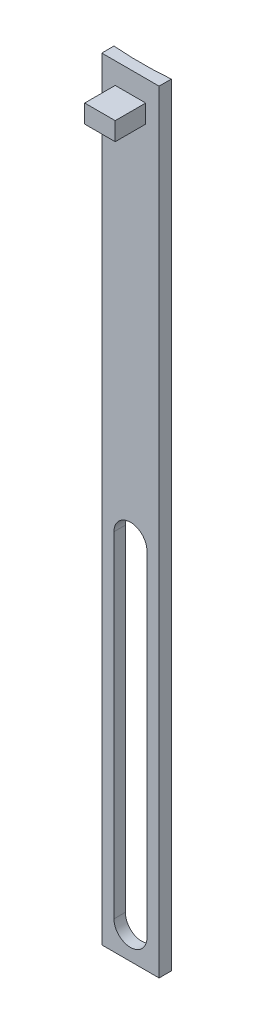
ISO-10303-21;
HEADER;
FILE_DESCRIPTION(('STEP AP214'),'2;1');
FILE_NAME('part.step','',(''),(''),'','','');
FILE_SCHEMA(('AUTOMOTIVE_DESIGN { 1 0 10303 214 1 1 1 1 }'));
ENDSEC;
DATA;
#1=APPLICATION_CONTEXT('core data for automotive mechanical design processes');
#2=APPLICATION_PROTOCOL_DEFINITION('international standard','automotive_design',2000,#1);
#3=PRODUCT_CONTEXT('',#1,'mechanical');
#4=PRODUCT('Part','Part','',(#3));
#5=PRODUCT_RELATED_PRODUCT_CATEGORY('part','',(#4));
#6=PRODUCT_DEFINITION_FORMATION('','',#4);
#7=PRODUCT_DEFINITION_CONTEXT('part definition',#1,'design');
#8=PRODUCT_DEFINITION('design','',#6,#7);
#9=PRODUCT_DEFINITION_SHAPE('','',#8);
#10=(LENGTH_UNIT() NAMED_UNIT(*) SI_UNIT(.MILLI.,.METRE.));
#11=(NAMED_UNIT(*) PLANE_ANGLE_UNIT() SI_UNIT($,.RADIAN.));
#12=(NAMED_UNIT(*) SI_UNIT($,.STERADIAN.) SOLID_ANGLE_UNIT());
#13=UNCERTAINTY_MEASURE_WITH_UNIT(LENGTH_MEASURE(1.E-05),#10,'distance_accuracy_value','');
#14=(GEOMETRIC_REPRESENTATION_CONTEXT(3) GLOBAL_UNCERTAINTY_ASSIGNED_CONTEXT((#13)) GLOBAL_UNIT_ASSIGNED_CONTEXT((#10,
#11,#12)) REPRESENTATION_CONTEXT('',''));
#15=CARTESIAN_POINT('',(0.,0.,0.));
#16=DIRECTION('',(0.,0.,1.));
#17=DIRECTION('',(1.,0.,0.));
#18=AXIS2_PLACEMENT_3D('',#15,#16,#17);
#19=CARTESIAN_POINT('',(0.,0.,1.));
#20=DIRECTION('',(0.,0.,1.));
#21=DIRECTION('',(1.,0.,0.));
#22=AXIS2_PLACEMENT_3D('',#19,#20,#21);
#23=PLANE('',#22);
#24=DIRECTION('',(0.,-1.,0.));
#25=VECTOR('',#24,1.);
#26=CARTESIAN_POINT('',(-2.69999999999999,0.,1.));
#27=LINE('',#26,#25);
#28=CARTESIAN_POINT('',(-2.69999999999999,-32.5000000000001,1.));
#29=VERTEX_POINT('',#28);
#30=CARTESIAN_POINT('',(-2.69999999999999,-87.5000000000001,1.));
#31=VERTEX_POINT('',#30);
#32=EDGE_CURVE('E267',#29,#31,#27,.T.);
#33=ORIENTED_EDGE('',*,*,#32,.F.);
#34=CARTESIAN_POINT('',(0.,-32.5000000000001,1.));
#35=DIRECTION('',(0.,0.,1.));
#36=DIRECTION('',(1.,0.,0.));
#37=AXIS2_PLACEMENT_3D('',#34,#35,#36);
#38=CIRCLE('',#37,2.7);
#39=CARTESIAN_POINT('',(2.70000000000001,-32.5000000000001,1.));
#40=VERTEX_POINT('',#39);
#41=EDGE_CURVE('E450',#29,#40,#38,.F.);
#42=ORIENTED_EDGE('',*,*,#41,.T.);
#43=DIRECTION('',(0.,-1.,0.));
#44=VECTOR('',#43,1.);
#45=CARTESIAN_POINT('',(2.7,0.,1.));
#46=LINE('',#45,#44);
#47=CARTESIAN_POINT('',(2.70000000000001,-87.5000000000001,1.));
#48=VERTEX_POINT('',#47);
#49=EDGE_CURVE('E447',#40,#48,#46,.T.);
#50=ORIENTED_EDGE('',*,*,#49,.T.);
#51=CARTESIAN_POINT('',(0.,-87.5000000000001,1.));
#52=DIRECTION('',(0.,0.,1.));
#53=DIRECTION('',(1.,0.,0.));
#54=AXIS2_PLACEMENT_3D('',#51,#52,#53);
#55=CIRCLE('',#54,2.7);
#56=EDGE_CURVE('E443',#31,#48,#55,.T.);
#57=ORIENTED_EDGE('',*,*,#56,.F.);
#58=EDGE_LOOP('',(#33,#42,#50,#57));
#59=FACE_BOUND('',#58,.T.);
#60=DIRECTION('',(0.,-1.,0.));
#61=VECTOR('',#60,1.);
#62=CARTESIAN_POINT('',(4.70000000000002,0.,1.));
#63=LINE('',#62,#61);
#64=CARTESIAN_POINT('',(4.7,34.4999999999999,1.));
#65=VERTEX_POINT('',#64);
#66=CARTESIAN_POINT('',(4.70000000000001,-92.2,1.));
#67=VERTEX_POINT('',#66);
#68=EDGE_CURVE('E272',#65,#67,#63,.T.);
#69=ORIENTED_EDGE('',*,*,#68,.F.);
#70=DIRECTION('',(1.,0.,0.));
#71=VECTOR('',#70,1.);
#72=CARTESIAN_POINT('',(0.,34.4999999999999,1.));
#73=LINE('',#72,#71);
#74=CARTESIAN_POINT('',(-4.7,34.4999999999999,1.));
#75=VERTEX_POINT('',#74);
#76=EDGE_CURVE('E438',#75,#65,#73,.T.);
#77=ORIENTED_EDGE('',*,*,#76,.F.);
#78=DIRECTION('',(0.,1.,0.));
#79=VECTOR('',#78,1.);
#80=CARTESIAN_POINT('',(-4.7,0.,1.));
#81=LINE('',#80,#79);
#82=CARTESIAN_POINT('',(-4.69999999999998,-92.2,1.));
#83=VERTEX_POINT('',#82);
#84=EDGE_CURVE('E399',#83,#75,#81,.T.);
#85=ORIENTED_EDGE('',*,*,#84,.F.);
#86=DIRECTION('',(1.,0.,0.));
#87=VECTOR('',#86,1.);
#88=CARTESIAN_POINT('',(0.,-92.2,1.));
#89=LINE('',#88,#87);
#90=EDGE_CURVE('E414',#83,#67,#89,.T.);
#91=ORIENTED_EDGE('',*,*,#90,.T.);
#92=EDGE_LOOP('',(#69,#77,#85,#91));
#93=FACE_BOUND('',#92,.T.);
#94=DIRECTION('',(0.,-1.,0.));
#95=VECTOR('',#94,1.);
#96=CARTESIAN_POINT('',(2.5,30.9999999999999,1.));
#97=LINE('',#96,#95);
#98=CARTESIAN_POINT('',(2.5,30.9999999999999,1.));
#99=VERTEX_POINT('',#98);
#100=CARTESIAN_POINT('',(2.5,27.9999999999999,1.));
#101=VERTEX_POINT('',#100);
#102=EDGE_CURVE('E190',#99,#101,#97,.T.);
#103=ORIENTED_EDGE('',*,*,#102,.T.);
#104=DIRECTION('',(1.,0.,0.));
#105=VECTOR('',#104,1.);
#106=CARTESIAN_POINT('',(-2.5,27.9999999999999,1.));
#107=LINE('',#106,#105);
#108=CARTESIAN_POINT('',(-2.5,27.9999999999999,1.));
#109=VERTEX_POINT('',#108);
#110=EDGE_CURVE('E170',#109,#101,#107,.T.);
#111=ORIENTED_EDGE('',*,*,#110,.F.);
#112=DIRECTION('',(0.,-1.,0.));
#113=VECTOR('',#112,1.);
#114=CARTESIAN_POINT('',(-2.5,30.9999999999999,1.));
#115=LINE('',#114,#113);
#116=CARTESIAN_POINT('',(-2.5,30.9999999999999,1.));
#117=VERTEX_POINT('',#116);
#118=EDGE_CURVE('E164',#117,#109,#115,.T.);
#119=ORIENTED_EDGE('',*,*,#118,.F.);
#120=DIRECTION('',(1.,0.,0.));
#121=VECTOR('',#120,1.);
#122=CARTESIAN_POINT('',(-2.5,30.9999999999999,1.));
#123=LINE('',#122,#121);
#124=EDGE_CURVE('E77',#117,#99,#123,.T.);
#125=ORIENTED_EDGE('',*,*,#124,.T.);
#126=EDGE_LOOP('',(#103,#111,#119,#125));
#127=FACE_BOUND('',#126,.T.);
#128=ADVANCED_FACE('F59',(#59,#93,#127),#23,.T.);
#129=CARTESIAN_POINT('',(4.70000000000002,0.,1.));
#130=DIRECTION('',(1.,0.,0.));
#131=DIRECTION('',(0.,1.,0.));
#132=AXIS2_PLACEMENT_3D('',#129,#130,#131);
#133=PLANE('',#132);
#134=DIRECTION('',(0.,-1.,0.));
#135=VECTOR('',#134,1.);
#136=CARTESIAN_POINT('',(4.70000000000002,0.,-1.));
#137=LINE('',#136,#135);
#138=CARTESIAN_POINT('',(4.70000000000002,34.4999999999999,-1.));
#139=VERTEX_POINT('',#138);
#140=CARTESIAN_POINT('',(4.70000000000002,-92.2,-1.));
#141=VERTEX_POINT('',#140);
#142=EDGE_CURVE('E431',#139,#141,#137,.T.);
#143=ORIENTED_EDGE('',*,*,#142,.F.);
#144=DIRECTION('',(0.,0.,-1.));
#145=VECTOR('',#144,1.);
#146=CARTESIAN_POINT('',(4.7,34.4999999999999,1.));
#147=LINE('',#146,#145);
#148=EDGE_CURVE('E12',#65,#139,#147,.T.);
#149=ORIENTED_EDGE('',*,*,#148,.F.);
#150=ORIENTED_EDGE('',*,*,#68,.T.);
#151=DIRECTION('',(0.,0.,-1.));
#152=VECTOR('',#151,1.);
#153=CARTESIAN_POINT('',(4.70000000000001,-92.2,1.));
#154=LINE('',#153,#152);
#155=EDGE_CURVE('E405',#67,#141,#154,.T.);
#156=ORIENTED_EDGE('',*,*,#155,.T.);
#157=EDGE_LOOP('',(#143,#149,#150,#156));
#158=FACE_BOUND('',#157,.T.);
#159=ADVANCED_FACE('F256',(#158),#133,.T.);
#160=CARTESIAN_POINT('',(0.,34.4999999999999,1.));
#161=DIRECTION('',(0.,1.,0.));
#162=DIRECTION('',(0.,0.,1.));
#163=AXIS2_PLACEMENT_3D('',#160,#161,#162);
#164=PLANE('',#163);
#165=CARTESIAN_POINT('',(0.,34.4999999999999,-57.8058975811491));
#166=DIRECTION('',(0.,1.,0.));
#167=DIRECTION('',(0.,0.,1.));
#168=AXIS2_PLACEMENT_3D('',#165,#166,#167);
#169=CIRCLE('',#168,57.);
#170=CARTESIAN_POINT('',(-4.70000000000002,34.4999999999999,-1.));
#171=VERTEX_POINT('',#170);
#172=EDGE_CURVE('E175',#171,#139,#169,.T.);
#173=ORIENTED_EDGE('',*,*,#172,.F.);
#174=DIRECTION('',(0.,0.,-1.));
#175=VECTOR('',#174,1.);
#176=CARTESIAN_POINT('',(-4.7,34.4999999999999,1.));
#177=LINE('',#176,#175);
#178=EDGE_CURVE('E69',#75,#171,#177,.T.);
#179=ORIENTED_EDGE('',*,*,#178,.F.);
#180=ORIENTED_EDGE('',*,*,#76,.T.);
#181=ORIENTED_EDGE('',*,*,#148,.T.);
#182=EDGE_LOOP('',(#173,#179,#180,#181));
#183=FACE_BOUND('',#182,.T.);
#184=ADVANCED_FACE('F261',(#183),#164,.T.);
#185=CARTESIAN_POINT('',(-4.7,0.,1.));
#186=DIRECTION('',(-1.,0.,0.));
#187=DIRECTION('',(0.,-1.,0.));
#188=AXIS2_PLACEMENT_3D('',#185,#186,#187);
#189=PLANE('',#188);
#190=DIRECTION('',(0.,1.,0.));
#191=VECTOR('',#190,1.);
#192=CARTESIAN_POINT('',(-4.7,0.,-1.));
#193=LINE('',#192,#191);
#194=CARTESIAN_POINT('',(-4.69999999999998,-92.2,-1.));
#195=VERTEX_POINT('',#194);
#196=EDGE_CURVE('E397',#195,#171,#193,.T.);
#197=ORIENTED_EDGE('',*,*,#196,.F.);
#198=DIRECTION('',(0.,0.,-1.));
#199=VECTOR('',#198,1.);
#200=CARTESIAN_POINT('',(-4.69999999999998,-92.2,1.));
#201=LINE('',#200,#199);
#202=EDGE_CURVE('E401',#83,#195,#201,.T.);
#203=ORIENTED_EDGE('',*,*,#202,.F.);
#204=ORIENTED_EDGE('',*,*,#84,.T.);
#205=ORIENTED_EDGE('',*,*,#178,.T.);
#206=EDGE_LOOP('',(#197,#203,#204,#205));
#207=FACE_BOUND('',#206,.T.);
#208=ADVANCED_FACE('F356',(#207),#189,.T.);
#209=CARTESIAN_POINT('',(-2.69999999999999,0.,1.));
#210=DIRECTION('',(1.,0.,0.));
#211=DIRECTION('',(0.,0.,-1.));
#212=AXIS2_PLACEMENT_3D('',#209,#210,#211);
#213=PLANE('',#212);
#214=DIRECTION('',(0.,1.,0.));
#215=VECTOR('',#214,1.);
#216=CARTESIAN_POINT('',(-2.69999999999999,-92.2,-0.869880860623236));
#217=LINE('',#216,#215);
#218=CARTESIAN_POINT('',(-2.69999999999999,-32.5000000000001,-0.869880860623236));
#219=VERTEX_POINT('',#218);
#220=CARTESIAN_POINT('',(-2.69999999999999,-87.5000000000001,-0.869880860623236));
#221=VERTEX_POINT('',#220);
#222=EDGE_CURVE('E85',#219,#221,#217,.F.);
#223=ORIENTED_EDGE('',*,*,#222,.F.);
#224=DIRECTION('',(0.,0.,-1.));
#225=VECTOR('',#224,1.);
#226=CARTESIAN_POINT('',(-2.69999999999999,-32.5000000000001,1.));
#227=LINE('',#226,#225);
#228=EDGE_CURVE('E63',#29,#219,#227,.T.);
#229=ORIENTED_EDGE('',*,*,#228,.F.);
#230=ORIENTED_EDGE('',*,*,#32,.T.);
#231=DIRECTION('',(0.,0.,-1.));
#232=VECTOR('',#231,1.);
#233=CARTESIAN_POINT('',(-2.69999999999999,-87.5000000000001,1.));
#234=LINE('',#233,#232);
#235=EDGE_CURVE('E409',#31,#221,#234,.T.);
#236=ORIENTED_EDGE('',*,*,#235,.T.);
#237=EDGE_LOOP('',(#223,#229,#230,#236));
#238=FACE_BOUND('',#237,.T.);
#239=ADVANCED_FACE('F61',(#238),#213,.T.);
#240=CARTESIAN_POINT('',(0.,-32.5000000000001,1.));
#241=DIRECTION('',(0.,0.,-1.));
#242=DIRECTION('',(-1.,0.,0.));
#243=AXIS2_PLACEMENT_3D('',#240,#241,#242);
#244=CYLINDRICAL_SURFACE('',#243,2.7);
#245=ORIENTED_EDGE('',*,*,#228,.T.);
#246=CARTESIAN_POINT('',(-2.69999999999999,-32.5000000000001,-0.869880860623236));
#247=CARTESIAN_POINT('',(-2.70000732456482,-32.4241053607509,-0.869882339341286));
#248=CARTESIAN_POINT('',(-2.69680003165618,-32.3482142297595,-0.869729142345489));
#249=CARTESIAN_POINT('',(-2.68401290431147,-32.1969757558752,-0.869124316677938));
#250=CARTESIAN_POINT('',(-2.67443340141628,-32.1216283848969,-0.868672703532539));
#251=CARTESIAN_POINT('',(-2.64896807420141,-31.9720622127172,-0.867482409008975));
#252=CARTESIAN_POINT('',(-2.63308697736561,-31.8978426086998,-0.866743942837953));
#253=CARTESIAN_POINT('',(-2.59514795867035,-31.7510247355525,-0.86500222291473));
#254=CARTESIAN_POINT('',(-2.57309010643287,-31.6784264481578,-0.863998972147085));
#255=CARTESIAN_POINT('',(-2.49783261171168,-31.463768816912,-0.860630913985079));
#256=CARTESIAN_POINT('',(-2.43553766536324,-31.3247803123233,-0.857907235652964));
#257=CARTESIAN_POINT('',(-2.2885658446912,-31.0593362776797,-0.851812236909449));
#258=CARTESIAN_POINT('',(-2.20389298514474,-30.9328785051007,-0.848441032698999));
#259=CARTESIAN_POINT('',(-2.01446568164372,-30.6958531654643,-0.841427135152572));
#260=CARTESIAN_POINT('',(-1.90969680358119,-30.585297120421,-0.837784247834748));
#261=CARTESIAN_POINT('',(-1.68307252986893,-30.3833248870339,-0.83063897686538));
#262=CARTESIAN_POINT('',(-1.56121453587472,-30.2919116145661,-0.82713661468457));
#263=CARTESIAN_POINT('',(-1.30381602729783,-30.1307966234203,-0.820665989202554));
#264=CARTESIAN_POINT('',(-1.16826969014489,-30.0611041960177,-0.817697954693192));
#265=CARTESIAN_POINT('',(-0.887392459809831,-29.9454748197964,-0.812632691945034));
#266=CARTESIAN_POINT('',(-0.742062238288388,-29.8995362421588,-0.810535404000451));
#267=CARTESIAN_POINT('',(-0.445848752406314,-29.8327443755039,-0.807449103913011));
#268=CARTESIAN_POINT('',(-0.294969673309991,-29.8118725640138,-0.806459273478599));
#269=CARTESIAN_POINT('',(0.00815735425410081,-29.7957496030039,-0.805696684593879));
#270=CARTESIAN_POINT('',(0.160405326592096,-29.8004989011234,-0.805923947408018));
#271=CARTESIAN_POINT('',(0.461814500668182,-29.8354688001901,-0.807569286789664));
#272=CARTESIAN_POINT('',(0.610978109864714,-29.8656687028844,-0.808986395685743));
#273=CARTESIAN_POINT('',(0.902115506682112,-29.9506503937841,-0.812850666304798));
#274=CARTESIAN_POINT('',(1.04408929808984,-30.0054321690421,-0.815297827485241));
#275=CARTESIAN_POINT('',(1.31688707696982,-30.1380474139353,-0.820948243884149));
#276=CARTESIAN_POINT('',(1.44770623310544,-30.2158908074458,-0.824151824484287));
#277=CARTESIAN_POINT('',(1.69442141309884,-30.3924086272794,-0.830954048103914));
#278=CARTESIAN_POINT('',(1.81031805738849,-30.4910821870981,-0.834552674687081));
#279=CARTESIAN_POINT('',(2.02401064082768,-30.7065601950441,-0.841743526625007));
#280=CARTESIAN_POINT('',(2.12179112848464,-30.8233799656187,-0.845335743950917));
#281=CARTESIAN_POINT('',(2.29638597382443,-31.0718316211869,-0.852106893692289));
#282=CARTESIAN_POINT('',(2.37319372789438,-31.2034681531014,-0.855285695772491));
#283=CARTESIAN_POINT('',(2.50365780431374,-31.4778427421657,-0.860871625750802));
#284=CARTESIAN_POINT('',(2.55729944465184,-31.6205877721326,-0.863278264026258));
#285=CARTESIAN_POINT('',(2.63976917285676,-31.9129614235305,-0.86704132837658));
#286=CARTESIAN_POINT('',(2.6686350732441,-32.0625791868277,-0.868399354515134));
#287=CARTESIAN_POINT('',(2.68983082504101,-32.2610025213748,-0.869399463231085));
#288=CARTESIAN_POINT('',(2.6936462557648,-32.3087642925624,-0.869579890839731));
#289=CARTESIAN_POINT('',(2.69872736855736,-32.4043442199358,-0.869820430977038));
#290=CARTESIAN_POINT('',(2.69999726823685,-32.4521621512877,-0.869880742521174));
#291=CARTESIAN_POINT('',(2.70000000000001,-32.5,-0.869880860623228));
#292=B_SPLINE_CURVE_WITH_KNOTS('',3,(#246,#247,#248,#249,#250,#251,#252,#253,#254,#255,#256,
#257,#258,#259,#260,#261,#262,#263,#264,#265,#266,#267,#268,#269,#270,#271,#272,#273,#274,#275,
#276,#277,#278,#279,#280,#281,#282,#283,#284,#285,#286,#287,#288,#289,#290,#291),.UNSPECIFIED.,
.F.,.F.,(4,2,2,2,2,2,2,2,2,2,2,2,2,2,2,2,2,2,2,2,2,2,4),(0.,0.227609703753393,0.455207566086378,
0.682635005331029,0.910059881204889,1.36471009872762,1.81927880366062,2.27417523673384,
2.72914091047107,3.18430093336528,3.63942974146323,4.09422203595259,4.54902227637293,
5.0034529972393,5.45788347875556,5.91250979553774,6.36711720425654,6.82211058598254,
7.2772470651506,7.73267157482233,8.18739977728913,8.33109489116103,8.47455172364968),.UNSPECIFIED.);
#293=CARTESIAN_POINT('',(2.70000000000002,-32.5000000000001,-0.869880860623236));
#294=VERTEX_POINT('',#293);
#295=EDGE_CURVE('E234',#219,#294,#292,.T.);
#296=ORIENTED_EDGE('',*,*,#295,.T.);
#297=DIRECTION('',(0.,0.,-1.));
#298=VECTOR('',#297,1.);
#299=CARTESIAN_POINT('',(2.70000000000001,-32.5000000000001,1.));
#300=LINE('',#299,#298);
#301=EDGE_CURVE('E417',#40,#294,#300,.T.);
#302=ORIENTED_EDGE('',*,*,#301,.F.);
#303=ORIENTED_EDGE('',*,*,#41,.F.);
#304=EDGE_LOOP('',(#245,#296,#302,#303));
#305=FACE_BOUND('',#304,.T.);
#306=ADVANCED_FACE('F243',(#305),#244,.F.);
#307=CARTESIAN_POINT('',(2.7,0.,1.));
#308=DIRECTION('',(1.,0.,0.));
#309=DIRECTION('',(0.,1.,0.));
#310=AXIS2_PLACEMENT_3D('',#307,#308,#309);
#311=PLANE('',#310);
#312=ORIENTED_EDGE('',*,*,#301,.T.);
#313=DIRECTION('',(0.,1.,0.));
#314=VECTOR('',#313,1.);
#315=CARTESIAN_POINT('',(2.70000000000002,-92.2,-0.869880860623236));
#316=LINE('',#315,#314);
#317=CARTESIAN_POINT('',(2.70000000000001,-87.5000000000001,-0.869880860623236));
#318=VERTEX_POINT('',#317);
#319=EDGE_CURVE('E219',#294,#318,#316,.F.);
#320=ORIENTED_EDGE('',*,*,#319,.T.);
#321=DIRECTION('',(0.,0.,-1.));
#322=VECTOR('',#321,1.);
#323=CARTESIAN_POINT('',(2.70000000000001,-87.5000000000001,1.));
#324=LINE('',#323,#322);
#325=EDGE_CURVE('E413',#48,#318,#324,.T.);
#326=ORIENTED_EDGE('',*,*,#325,.F.);
#327=ORIENTED_EDGE('',*,*,#49,.F.);
#328=EDGE_LOOP('',(#312,#320,#326,#327));
#329=FACE_BOUND('',#328,.T.);
#330=ADVANCED_FACE('F246',(#329),#311,.F.);
#331=CARTESIAN_POINT('',(0.,-87.5000000000001,1.));
#332=DIRECTION('',(0.,0.,-1.));
#333=DIRECTION('',(-1.,0.,0.));
#334=AXIS2_PLACEMENT_3D('',#331,#332,#333);
#335=CYLINDRICAL_SURFACE('',#334,2.7);
#336=CARTESIAN_POINT('',(-2.69999999999999,-87.5000000000001,-0.869880860623236));
#337=CARTESIAN_POINT('',(-2.70000732456483,-87.5758946392492,-0.86988233934129));
#338=CARTESIAN_POINT('',(-2.69680003165618,-87.6517857702406,-0.869729142345491));
#339=CARTESIAN_POINT('',(-2.68401290431147,-87.8030242441249,-0.869124316677935));
#340=CARTESIAN_POINT('',(-2.67443340141628,-87.8783716151032,-0.868672703532534));
#341=CARTESIAN_POINT('',(-2.64896807420141,-88.0279377872829,-0.867482409008978));
#342=CARTESIAN_POINT('',(-2.63308697736562,-88.1021573913003,-0.866743942837966));
#343=CARTESIAN_POINT('',(-2.59514795867035,-88.2489752644476,-0.865002222914743));
#344=CARTESIAN_POINT('',(-2.57309010643287,-88.3215735518423,-0.863998972147089));
#345=CARTESIAN_POINT('',(-2.49783261171168,-88.5362311830881,-0.860630913985069));
#346=CARTESIAN_POINT('',(-2.43553766536323,-88.6752196876768,-0.857907235652962));
#347=CARTESIAN_POINT('',(-2.2885658446912,-88.9406637223204,-0.85181223690945));
#348=CARTESIAN_POINT('',(-2.20389298514475,-89.0671214948994,-0.848441032698996));
#349=CARTESIAN_POINT('',(-2.01446568164372,-89.3041468345358,-0.841427135152574));
#350=CARTESIAN_POINT('',(-1.90969680358119,-89.4147028795791,-0.837784247834761));
#351=CARTESIAN_POINT('',(-1.68307252986893,-89.6166751129662,-0.830638976865393));
#352=CARTESIAN_POINT('',(-1.56121453587473,-89.708088385434,-0.827136614684572));
#353=CARTESIAN_POINT('',(-1.30381602729783,-89.8692033765799,-0.82066598920255));
#354=CARTESIAN_POINT('',(-1.16826969014489,-89.9388958039824,-0.817697954693193));
#355=CARTESIAN_POINT('',(-0.887392459809831,-90.0545251802037,-0.81263269194504));
#356=CARTESIAN_POINT('',(-0.742062238288389,-90.1004637578413,-0.810535404000459));
#357=CARTESIAN_POINT('',(-0.445848752406317,-90.1672556244962,-0.807449103913015));
#358=CARTESIAN_POINT('',(-0.294969673309993,-90.1881274359863,-0.806459273478597));
#359=CARTESIAN_POINT('',(0.00815735425409875,-90.2042503969962,-0.805696684593874));
#360=CARTESIAN_POINT('',(0.160405326592094,-90.1995010988767,-0.805923947408016));
#361=CARTESIAN_POINT('',(0.461814500668178,-90.1645311998101,-0.807569286789664));
#362=CARTESIAN_POINT('',(0.61097810986471,-90.1343312971157,-0.808986395685742));
#363=CARTESIAN_POINT('',(0.902115506682108,-90.049349606216,-0.812850666304796));
#364=CARTESIAN_POINT('',(1.04408929808984,-89.994567830958,-0.81529782748524));
#365=CARTESIAN_POINT('',(1.31688707696981,-89.8619525860648,-0.820948243884149));
#366=CARTESIAN_POINT('',(1.44770623310544,-89.7841091925543,-0.824151824484286));
#367=CARTESIAN_POINT('',(1.69442141309884,-89.6075913727207,-0.830954048103913));
#368=CARTESIAN_POINT('',(1.81031805738848,-89.508917812902,-0.83455267468708));
#369=CARTESIAN_POINT('',(2.02401064082768,-89.293439804956,-0.841743526625007));
#370=CARTESIAN_POINT('',(2.12179112848464,-89.1766200343814,-0.845335743950919));
#371=CARTESIAN_POINT('',(2.29638597382443,-88.9281683788132,-0.852106893692294));
#372=CARTESIAN_POINT('',(2.37319372789438,-88.7965318468987,-0.855285695772497));
#373=CARTESIAN_POINT('',(2.50365780431374,-88.5221572578344,-0.860871625750809));
#374=CARTESIAN_POINT('',(2.55729944465184,-88.3794122278675,-0.863278264026263));
#375=CARTESIAN_POINT('',(2.63976917285676,-88.0870385764696,-0.867041328376582));
#376=CARTESIAN_POINT('',(2.6686350732441,-87.9374208131724,-0.868399354515135));
#377=CARTESIAN_POINT('',(2.68983082504101,-87.7389974786253,-0.869399463231084));
#378=CARTESIAN_POINT('',(2.6936462557648,-87.6912357074377,-0.869579890839731));
#379=CARTESIAN_POINT('',(2.69872736855736,-87.5956557800643,-0.869820430977037));
#380=CARTESIAN_POINT('',(2.69999726823685,-87.5478378487124,-0.869880742521174));
#381=CARTESIAN_POINT('',(2.70000000000001,-87.5000000000001,-0.869880860623228));
#382=B_SPLINE_CURVE_WITH_KNOTS('',3,(#336,#337,#338,#339,#340,#341,#342,#343,#344,#345,#346,
#347,#348,#349,#350,#351,#352,#353,#354,#355,#356,#357,#358,#359,#360,#361,#362,#363,#364,#365,
#366,#367,#368,#369,#370,#371,#372,#373,#374,#375,#376,#377,#378,#379,#380,#381),.UNSPECIFIED.,
.F.,.F.,(4,2,2,2,2,2,2,2,2,2,2,2,2,2,2,2,2,2,2,2,2,2,4),(0.,0.227609703753379,0.455207566086364,
0.682635005331007,0.910059881204889,1.36471009872762,1.81927880366062,2.27417523673383,
2.72914091047107,3.18430093336528,3.63942974146323,4.09422203595259,4.54902227637293,
5.00345299723929,5.45788347875556,5.91250979553773,6.36711720425653,6.82211058598252,
7.27724706515059,7.73267157482233,8.18739977728913,8.33109489116103,8.47455172364968),.UNSPECIFIED.);
#383=EDGE_CURVE('E210',#221,#318,#382,.T.);
#384=ORIENTED_EDGE('',*,*,#383,.F.);
#385=ORIENTED_EDGE('',*,*,#235,.F.);
#386=ORIENTED_EDGE('',*,*,#56,.T.);
#387=ORIENTED_EDGE('',*,*,#325,.T.);
#388=EDGE_LOOP('',(#384,#385,#386,#387));
#389=FACE_BOUND('',#388,.T.);
#390=ADVANCED_FACE('F221',(#389),#335,.F.);
#391=CARTESIAN_POINT('',(0.,-92.2,1.));
#392=DIRECTION('',(0.,1.,0.));
#393=DIRECTION('',(0.,0.,1.));
#394=AXIS2_PLACEMENT_3D('',#391,#392,#393);
#395=PLANE('',#394);
#396=ORIENTED_EDGE('',*,*,#202,.T.);
#397=CARTESIAN_POINT('',(0.,-92.2,-57.8058975811491));
#398=DIRECTION('',(0.,1.,0.));
#399=DIRECTION('',(0.,0.,1.));
#400=AXIS2_PLACEMENT_3D('',#397,#398,#399);
#401=CIRCLE('',#400,57.);
#402=EDGE_CURVE('E206',#195,#141,#401,.T.);
#403=ORIENTED_EDGE('',*,*,#402,.T.);
#404=ORIENTED_EDGE('',*,*,#155,.F.);
#405=ORIENTED_EDGE('',*,*,#90,.F.);
#406=EDGE_LOOP('',(#396,#403,#404,#405));
#407=FACE_BOUND('',#406,.T.);
#408=ADVANCED_FACE('F230',(#407),#395,.F.);
#409=CARTESIAN_POINT('',(0.,-92.2,-57.8058975811491));
#410=DIRECTION('',(0.,1.,0.));
#411=DIRECTION('',(0.,0.,1.));
#412=AXIS2_PLACEMENT_3D('',#409,#410,#411);
#413=CYLINDRICAL_SURFACE('',#412,57.);
#414=ORIENTED_EDGE('',*,*,#222,.T.);
#415=ORIENTED_EDGE('',*,*,#383,.T.);
#416=ORIENTED_EDGE('',*,*,#319,.F.);
#417=ORIENTED_EDGE('',*,*,#295,.F.);
#418=EDGE_LOOP('',(#414,#415,#416,#417));
#419=FACE_BOUND('',#418,.T.);
#420=ORIENTED_EDGE('',*,*,#402,.F.);
#421=ORIENTED_EDGE('',*,*,#196,.T.);
#422=ORIENTED_EDGE('',*,*,#172,.T.);
#423=ORIENTED_EDGE('',*,*,#142,.T.);
#424=EDGE_LOOP('',(#420,#421,#422,#423));
#425=FACE_BOUND('',#424,.T.);
#426=ADVANCED_FACE('F225',(#419,#425),#413,.F.);
#427=CARTESIAN_POINT('',(-2.5,27.9999999999999,6.));
#428=DIRECTION('',(0.,1.,0.));
#429=DIRECTION('',(0.,0.,1.));
#430=AXIS2_PLACEMENT_3D('',#427,#428,#429);
#431=PLANE('',#430);
#432=ORIENTED_EDGE('',*,*,#110,.T.);
#433=DIRECTION('',(0.,0.,-1.));
#434=VECTOR('',#433,1.);
#435=CARTESIAN_POINT('',(2.5,27.9999999999999,6.));
#436=LINE('',#435,#434);
#437=CARTESIAN_POINT('',(2.5,27.9999999999999,6.));
#438=VERTEX_POINT('',#437);
#439=EDGE_CURVE('E167',#438,#101,#436,.T.);
#440=ORIENTED_EDGE('',*,*,#439,.F.);
#441=DIRECTION('',(1.,0.,0.));
#442=VECTOR('',#441,1.);
#443=CARTESIAN_POINT('',(-2.5,27.9999999999999,6.));
#444=LINE('',#443,#442);
#445=CARTESIAN_POINT('',(-2.5,27.9999999999999,6.));
#446=VERTEX_POINT('',#445);
#447=EDGE_CURVE('E151',#446,#438,#444,.T.);
#448=ORIENTED_EDGE('',*,*,#447,.F.);
#449=DIRECTION('',(0.,0.,-1.));
#450=VECTOR('',#449,1.);
#451=CARTESIAN_POINT('',(-2.5,27.9999999999999,6.));
#452=LINE('',#451,#450);
#453=EDGE_CURVE('E187',#446,#109,#452,.T.);
#454=ORIENTED_EDGE('',*,*,#453,.T.);
#455=EDGE_LOOP('',(#432,#440,#448,#454));
#456=FACE_BOUND('',#455,.T.);
#457=ADVANCED_FACE('F168',(#456),#431,.F.);
#458=CARTESIAN_POINT('',(2.5,30.9999999999999,6.));
#459=DIRECTION('',(1.,0.,0.));
#460=DIRECTION('',(0.,1.,0.));
#461=AXIS2_PLACEMENT_3D('',#458,#459,#460);
#462=PLANE('',#461);
#463=ORIENTED_EDGE('',*,*,#102,.F.);
#464=DIRECTION('',(0.,0.,-1.));
#465=VECTOR('',#464,1.);
#466=CARTESIAN_POINT('',(2.5,30.9999999999999,6.));
#467=LINE('',#466,#465);
#468=CARTESIAN_POINT('',(2.5,30.9999999999999,6.));
#469=VERTEX_POINT('',#468);
#470=EDGE_CURVE('E176',#469,#99,#467,.T.);
#471=ORIENTED_EDGE('',*,*,#470,.F.);
#472=DIRECTION('',(0.,-1.,0.));
#473=VECTOR('',#472,1.);
#474=CARTESIAN_POINT('',(2.5,30.9999999999999,6.));
#475=LINE('',#474,#473);
#476=EDGE_CURVE('E156',#469,#438,#475,.T.);
#477=ORIENTED_EDGE('',*,*,#476,.T.);
#478=ORIENTED_EDGE('',*,*,#439,.T.);
#479=EDGE_LOOP('',(#463,#471,#477,#478));
#480=FACE_BOUND('',#479,.T.);
#481=ADVANCED_FACE('F178',(#480),#462,.T.);
#482=CARTESIAN_POINT('',(-2.5,30.9999999999999,6.));
#483=DIRECTION('',(0.,1.,0.));
#484=DIRECTION('',(0.,0.,1.));
#485=AXIS2_PLACEMENT_3D('',#482,#483,#484);
#486=PLANE('',#485);
#487=ORIENTED_EDGE('',*,*,#124,.F.);
#488=DIRECTION('',(0.,0.,-1.));
#489=VECTOR('',#488,1.);
#490=CARTESIAN_POINT('',(-2.5,30.9999999999999,6.));
#491=LINE('',#490,#489);
#492=CARTESIAN_POINT('',(-2.5,30.9999999999999,6.));
#493=VERTEX_POINT('',#492);
#494=EDGE_CURVE('E199',#493,#117,#491,.T.);
#495=ORIENTED_EDGE('',*,*,#494,.F.);
#496=DIRECTION('',(1.,0.,0.));
#497=VECTOR('',#496,1.);
#498=CARTESIAN_POINT('',(-2.5,30.9999999999999,6.));
#499=LINE('',#498,#497);
#500=EDGE_CURVE('E180',#493,#469,#499,.T.);
#501=ORIENTED_EDGE('',*,*,#500,.T.);
#502=ORIENTED_EDGE('',*,*,#470,.T.);
#503=EDGE_LOOP('',(#487,#495,#501,#502));
#504=FACE_BOUND('',#503,.T.);
#505=ADVANCED_FACE('F277',(#504),#486,.T.);
#506=CARTESIAN_POINT('',(-2.5,30.9999999999999,6.));
#507=DIRECTION('',(1.,0.,0.));
#508=DIRECTION('',(0.,0.,-1.));
#509=AXIS2_PLACEMENT_3D('',#506,#507,#508);
#510=PLANE('',#509);
#511=ORIENTED_EDGE('',*,*,#118,.T.);
#512=ORIENTED_EDGE('',*,*,#453,.F.);
#513=DIRECTION('',(0.,-1.,0.));
#514=VECTOR('',#513,1.);
#515=CARTESIAN_POINT('',(-2.5,30.9999999999999,6.));
#516=LINE('',#515,#514);
#517=EDGE_CURVE('E159',#493,#446,#516,.T.);
#518=ORIENTED_EDGE('',*,*,#517,.F.);
#519=ORIENTED_EDGE('',*,*,#494,.T.);
#520=EDGE_LOOP('',(#511,#512,#518,#519));
#521=FACE_BOUND('',#520,.T.);
#522=ADVANCED_FACE('F276',(#521),#510,.F.);
#523=CARTESIAN_POINT('',(0.,0.,6.));
#524=DIRECTION('',(0.,0.,-1.));
#525=DIRECTION('',(-1.,0.,0.));
#526=AXIS2_PLACEMENT_3D('',#523,#524,#525);
#527=PLANE('',#526);
#528=ORIENTED_EDGE('',*,*,#447,.T.);
#529=ORIENTED_EDGE('',*,*,#476,.F.);
#530=ORIENTED_EDGE('',*,*,#500,.F.);
#531=ORIENTED_EDGE('',*,*,#517,.T.);
#532=EDGE_LOOP('',(#528,#529,#530,#531));
#533=FACE_BOUND('',#532,.T.);
#534=ADVANCED_FACE('F153',(#533),#527,.F.);
#535=CLOSED_SHELL('',(#128,#159,#184,#208,#239,#306,#330,#390,#408,#426,#457,#481,#505,#522,#534));
#536=MANIFOLD_SOLID_BREP('B2',#535);
#537=ADVANCED_BREP_SHAPE_REPRESENTATION('',(#18,#536),#14);
#538=SHAPE_DEFINITION_REPRESENTATION(#9,#537);
ENDSEC;
END-ISO-10303-21;
